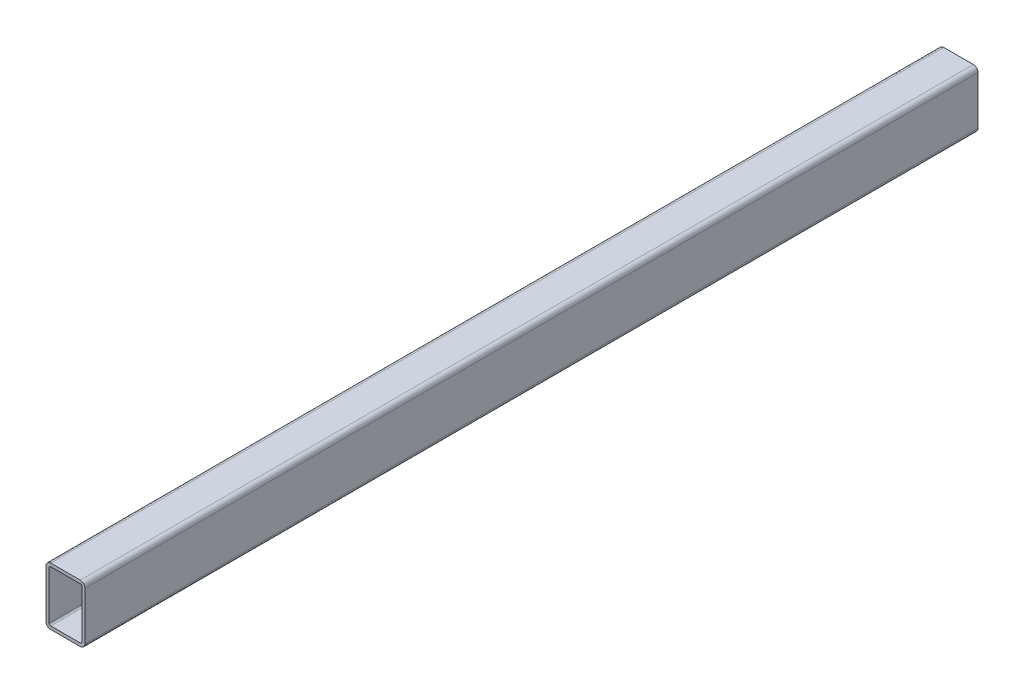
ISO-10303-21;
HEADER;
FILE_DESCRIPTION(('STEP AP214'),'2;1');
FILE_NAME('part.step','',(''),(''),'','','');
FILE_SCHEMA(('AUTOMOTIVE_DESIGN { 1 0 10303 214 1 1 1 1 }'));
ENDSEC;
DATA;
#1=APPLICATION_CONTEXT('core data for automotive mechanical design processes');
#2=APPLICATION_PROTOCOL_DEFINITION('international standard','automotive_design',2000,#1);
#3=PRODUCT_CONTEXT('',#1,'mechanical');
#4=PRODUCT('Part','Part','',(#3));
#5=PRODUCT_RELATED_PRODUCT_CATEGORY('part','',(#4));
#6=PRODUCT_DEFINITION_FORMATION('','',#4);
#7=PRODUCT_DEFINITION_CONTEXT('part definition',#1,'design');
#8=PRODUCT_DEFINITION('design','',#6,#7);
#9=PRODUCT_DEFINITION_SHAPE('','',#8);
#10=(LENGTH_UNIT() NAMED_UNIT(*) SI_UNIT(.MILLI.,.METRE.));
#11=(NAMED_UNIT(*) PLANE_ANGLE_UNIT() SI_UNIT($,.RADIAN.));
#12=(NAMED_UNIT(*) SI_UNIT($,.STERADIAN.) SOLID_ANGLE_UNIT());
#13=UNCERTAINTY_MEASURE_WITH_UNIT(LENGTH_MEASURE(1.E-05),#10,'distance_accuracy_value','');
#14=(GEOMETRIC_REPRESENTATION_CONTEXT(3) GLOBAL_UNCERTAINTY_ASSIGNED_CONTEXT((#13)) GLOBAL_UNIT_ASSIGNED_CONTEXT((#10,
#11,#12)) REPRESENTATION_CONTEXT('',''));
#15=CARTESIAN_POINT('',(0.,0.,0.));
#16=DIRECTION('',(0.,0.,1.));
#17=DIRECTION('',(1.,0.,0.));
#18=AXIS2_PLACEMENT_3D('',#15,#16,#17);
#19=CARTESIAN_POINT('',(-9.50000000000001,34.,287.));
#20=DIRECTION('',(0.,0.,1.));
#21=DIRECTION('',(1.,0.,0.));
#22=AXIS2_PLACEMENT_3D('',#19,#20,#21);
#23=PLANE('',#22);
#24=CARTESIAN_POINT('',(-9.50000000000001,34.,287.));
#25=DIRECTION('',(0.,0.,1.));
#26=DIRECTION('',(1.,0.,0.));
#27=AXIS2_PLACEMENT_3D('',#24,#25,#26);
#28=CIRCLE('',#27,3.);
#29=CARTESIAN_POINT('',(-9.49999999999999,37.,287.));
#30=VERTEX_POINT('',#29);
#31=CARTESIAN_POINT('',(-12.5,34.,287.));
#32=VERTEX_POINT('',#31);
#33=EDGE_CURVE('E262',#30,#32,#28,.T.);
#34=ORIENTED_EDGE('',*,*,#33,.T.);
#35=DIRECTION('',(0.,-1.,0.));
#36=VECTOR('',#35,1.);
#37=CARTESIAN_POINT('',(-12.5,34.,287.));
#38=LINE('',#37,#36);
#39=CARTESIAN_POINT('',(-12.5,3.00000000000002,287.));
#40=VERTEX_POINT('',#39);
#41=EDGE_CURVE('E265',#32,#40,#38,.T.);
#42=ORIENTED_EDGE('',*,*,#41,.T.);
#43=CARTESIAN_POINT('',(-9.5,3.,287.));
#44=DIRECTION('',(0.,0.,1.));
#45=DIRECTION('',(1.,0.,0.));
#46=AXIS2_PLACEMENT_3D('',#43,#44,#45);
#47=CIRCLE('',#46,3.);
#48=CARTESIAN_POINT('',(-9.49999999999998,0.,287.));
#49=VERTEX_POINT('',#48);
#50=EDGE_CURVE('E268',#40,#49,#47,.T.);
#51=ORIENTED_EDGE('',*,*,#50,.T.);
#52=DIRECTION('',(1.,0.,0.));
#53=VECTOR('',#52,1.);
#54=CARTESIAN_POINT('',(-9.49999999999998,0.,287.));
#55=LINE('',#54,#53);
#56=CARTESIAN_POINT('',(9.49999999999998,0.,287.));
#57=VERTEX_POINT('',#56);
#58=EDGE_CURVE('E270',#49,#57,#55,.T.);
#59=ORIENTED_EDGE('',*,*,#58,.T.);
#60=CARTESIAN_POINT('',(9.5,3.,287.));
#61=DIRECTION('',(0.,0.,1.));
#62=DIRECTION('',(1.,0.,0.));
#63=AXIS2_PLACEMENT_3D('',#60,#61,#62);
#64=CIRCLE('',#63,3.);
#65=CARTESIAN_POINT('',(12.5,3.00000000000002,287.));
#66=VERTEX_POINT('',#65);
#67=EDGE_CURVE('E272',#57,#66,#64,.T.);
#68=ORIENTED_EDGE('',*,*,#67,.T.);
#69=DIRECTION('',(0.,-1.,0.));
#70=VECTOR('',#69,1.);
#71=CARTESIAN_POINT('',(12.5,34.,287.));
#72=LINE('',#71,#70);
#73=CARTESIAN_POINT('',(12.5,34.,287.));
#74=VERTEX_POINT('',#73);
#75=EDGE_CURVE('E274',#74,#66,#72,.T.);
#76=ORIENTED_EDGE('',*,*,#75,.F.);
#77=CARTESIAN_POINT('',(9.50000000000001,34.,287.));
#78=DIRECTION('',(0.,0.,-1.));
#79=DIRECTION('',(-1.,0.,0.));
#80=AXIS2_PLACEMENT_3D('',#77,#78,#79);
#81=CIRCLE('',#80,3.);
#82=CARTESIAN_POINT('',(9.49999999999999,37.,287.));
#83=VERTEX_POINT('',#82);
#84=EDGE_CURVE('E277',#83,#74,#81,.T.);
#85=ORIENTED_EDGE('',*,*,#84,.F.);
#86=DIRECTION('',(1.,0.,0.));
#87=VECTOR('',#86,1.);
#88=CARTESIAN_POINT('',(-9.49999999999999,37.,287.));
#89=LINE('',#88,#87);
#90=EDGE_CURVE('E280',#30,#83,#89,.T.);
#91=ORIENTED_EDGE('',*,*,#90,.F.);
#92=EDGE_LOOP('',(#34,#42,#51,#59,#68,#76,#85,#91));
#93=FACE_BOUND('',#92,.T.);
#94=DIRECTION('',(0.,-1.,0.));
#95=VECTOR('',#94,1.);
#96=CARTESIAN_POINT('',(-10.5,34.,287.));
#97=LINE('',#96,#95);
#98=CARTESIAN_POINT('',(-10.5,34.,287.));
#99=VERTEX_POINT('',#98);
#100=CARTESIAN_POINT('',(-10.5,3.00000000000002,287.));
#101=VERTEX_POINT('',#100);
#102=EDGE_CURVE('E204',#99,#101,#97,.T.);
#103=ORIENTED_EDGE('',*,*,#102,.F.);
#104=CARTESIAN_POINT('',(-9.50000000000001,34.,287.));
#105=DIRECTION('',(0.,0.,1.));
#106=DIRECTION('',(1.,0.,0.));
#107=AXIS2_PLACEMENT_3D('',#104,#105,#106);
#108=CIRCLE('',#107,1.);
#109=CARTESIAN_POINT('',(-9.5,35.,287.));
#110=VERTEX_POINT('',#109);
#111=EDGE_CURVE('E195',#110,#99,#108,.T.);
#112=ORIENTED_EDGE('',*,*,#111,.F.);
#113=DIRECTION('',(1.,0.,0.));
#114=VECTOR('',#113,1.);
#115=CARTESIAN_POINT('',(-9.49999999999999,35.,287.));
#116=LINE('',#115,#114);
#117=CARTESIAN_POINT('',(9.49999999999999,35.,287.));
#118=VERTEX_POINT('',#117);
#119=EDGE_CURVE('E229',#110,#118,#116,.T.);
#120=ORIENTED_EDGE('',*,*,#119,.T.);
#121=CARTESIAN_POINT('',(9.50000000000001,34.,287.));
#122=DIRECTION('',(0.,0.,1.));
#123=DIRECTION('',(1.,0.,0.));
#124=AXIS2_PLACEMENT_3D('',#121,#122,#123);
#125=CIRCLE('',#124,1.);
#126=CARTESIAN_POINT('',(10.5,34.,287.));
#127=VERTEX_POINT('',#126);
#128=EDGE_CURVE('E98',#118,#127,#125,.F.);
#129=ORIENTED_EDGE('',*,*,#128,.T.);
#130=DIRECTION('',(0.,-1.,0.));
#131=VECTOR('',#130,1.);
#132=CARTESIAN_POINT('',(10.5,34.,287.));
#133=LINE('',#132,#131);
#134=CARTESIAN_POINT('',(10.5,3.00000000000002,287.));
#135=VERTEX_POINT('',#134);
#136=EDGE_CURVE('E225',#127,#135,#133,.T.);
#137=ORIENTED_EDGE('',*,*,#136,.T.);
#138=CARTESIAN_POINT('',(9.5,3.,287.));
#139=DIRECTION('',(0.,0.,1.));
#140=DIRECTION('',(1.,0.,0.));
#141=AXIS2_PLACEMENT_3D('',#138,#139,#140);
#142=CIRCLE('',#141,1.);
#143=CARTESIAN_POINT('',(9.49999999999998,2.,287.));
#144=VERTEX_POINT('',#143);
#145=EDGE_CURVE('E223',#144,#135,#142,.T.);
#146=ORIENTED_EDGE('',*,*,#145,.F.);
#147=DIRECTION('',(1.,0.,0.));
#148=VECTOR('',#147,1.);
#149=CARTESIAN_POINT('',(-9.49999999999998,2.,287.));
#150=LINE('',#149,#148);
#151=CARTESIAN_POINT('',(-9.49999999999999,2.,287.));
#152=VERTEX_POINT('',#151);
#153=EDGE_CURVE('E219',#152,#144,#150,.T.);
#154=ORIENTED_EDGE('',*,*,#153,.F.);
#155=CARTESIAN_POINT('',(-9.5,3.,287.));
#156=DIRECTION('',(0.,0.,1.));
#157=DIRECTION('',(1.,0.,0.));
#158=AXIS2_PLACEMENT_3D('',#155,#156,#157);
#159=CIRCLE('',#158,1.);
#160=EDGE_CURVE('E217',#101,#152,#159,.T.);
#161=ORIENTED_EDGE('',*,*,#160,.F.);
#162=EDGE_LOOP('',(#103,#112,#120,#129,#137,#146,#154,#161));
#163=FACE_BOUND('',#162,.T.);
#164=ADVANCED_FACE('F83',(#93,#163),#23,.T.);
#165=CARTESIAN_POINT('',(-9.50000000000001,34.,-287.));
#166=DIRECTION('',(0.,0.,1.));
#167=DIRECTION('',(1.,0.,0.));
#168=AXIS2_PLACEMENT_3D('',#165,#166,#167);
#169=PLANE('',#168);
#170=CARTESIAN_POINT('',(-9.50000000000001,34.,-287.));
#171=DIRECTION('',(0.,0.,1.));
#172=DIRECTION('',(1.,0.,0.));
#173=AXIS2_PLACEMENT_3D('',#170,#171,#172);
#174=CIRCLE('',#173,3.);
#175=CARTESIAN_POINT('',(-9.49999999999999,37.,-287.));
#176=VERTEX_POINT('',#175);
#177=CARTESIAN_POINT('',(-12.5,34.,-287.));
#178=VERTEX_POINT('',#177);
#179=EDGE_CURVE('E212',#176,#178,#174,.T.);
#180=ORIENTED_EDGE('',*,*,#179,.F.);
#181=DIRECTION('',(1.,0.,0.));
#182=VECTOR('',#181,1.);
#183=CARTESIAN_POINT('',(-9.49999999999999,37.,-287.));
#184=LINE('',#183,#182);
#185=CARTESIAN_POINT('',(9.49999999999999,37.,-287.));
#186=VERTEX_POINT('',#185);
#187=EDGE_CURVE('E266',#176,#186,#184,.T.);
#188=ORIENTED_EDGE('',*,*,#187,.T.);
#189=CARTESIAN_POINT('',(9.50000000000001,34.,-287.));
#190=DIRECTION('',(0.,0.,-1.));
#191=DIRECTION('',(-1.,0.,0.));
#192=AXIS2_PLACEMENT_3D('',#189,#190,#191);
#193=CIRCLE('',#192,3.);
#194=CARTESIAN_POINT('',(12.5,34.,-287.));
#195=VERTEX_POINT('',#194);
#196=EDGE_CURVE('E298',#186,#195,#193,.T.);
#197=ORIENTED_EDGE('',*,*,#196,.T.);
#198=DIRECTION('',(0.,-1.,0.));
#199=VECTOR('',#198,1.);
#200=CARTESIAN_POINT('',(12.5,34.,-287.));
#201=LINE('',#200,#199);
#202=CARTESIAN_POINT('',(12.5,3.00000000000002,-287.));
#203=VERTEX_POINT('',#202);
#204=EDGE_CURVE('E295',#195,#203,#201,.T.);
#205=ORIENTED_EDGE('',*,*,#204,.T.);
#206=CARTESIAN_POINT('',(9.5,3.,-287.));
#207=DIRECTION('',(0.,0.,1.));
#208=DIRECTION('',(1.,0.,0.));
#209=AXIS2_PLACEMENT_3D('',#206,#207,#208);
#210=CIRCLE('',#209,3.);
#211=CARTESIAN_POINT('',(9.49999999999998,0.,-287.));
#212=VERTEX_POINT('',#211);
#213=EDGE_CURVE('E292',#212,#203,#210,.T.);
#214=ORIENTED_EDGE('',*,*,#213,.F.);
#215=DIRECTION('',(1.,0.,0.));
#216=VECTOR('',#215,1.);
#217=CARTESIAN_POINT('',(-9.49999999999998,0.,-287.));
#218=LINE('',#217,#216);
#219=CARTESIAN_POINT('',(-9.49999999999998,0.,-287.));
#220=VERTEX_POINT('',#219);
#221=EDGE_CURVE('E290',#220,#212,#218,.T.);
#222=ORIENTED_EDGE('',*,*,#221,.F.);
#223=CARTESIAN_POINT('',(-9.5,3.,-287.));
#224=DIRECTION('',(0.,0.,1.));
#225=DIRECTION('',(1.,0.,0.));
#226=AXIS2_PLACEMENT_3D('',#223,#224,#225);
#227=CIRCLE('',#226,3.);
#228=CARTESIAN_POINT('',(-12.5,3.00000000000002,-287.));
#229=VERTEX_POINT('',#228);
#230=EDGE_CURVE('E288',#229,#220,#227,.T.);
#231=ORIENTED_EDGE('',*,*,#230,.F.);
#232=DIRECTION('',(0.,-1.,0.));
#233=VECTOR('',#232,1.);
#234=CARTESIAN_POINT('',(-12.5,34.,-287.));
#235=LINE('',#234,#233);
#236=EDGE_CURVE('E286',#178,#229,#235,.T.);
#237=ORIENTED_EDGE('',*,*,#236,.F.);
#238=EDGE_LOOP('',(#180,#188,#197,#205,#214,#222,#231,#237));
#239=FACE_BOUND('',#238,.T.);
#240=CARTESIAN_POINT('',(-9.50000000000001,34.,-287.));
#241=DIRECTION('',(0.,0.,1.));
#242=DIRECTION('',(1.,0.,0.));
#243=AXIS2_PLACEMENT_3D('',#240,#241,#242);
#244=CIRCLE('',#243,1.);
#245=CARTESIAN_POINT('',(-9.5,35.,-287.));
#246=VERTEX_POINT('',#245);
#247=CARTESIAN_POINT('',(-10.5,34.,-287.));
#248=VERTEX_POINT('',#247);
#249=EDGE_CURVE('E106',#246,#248,#244,.T.);
#250=ORIENTED_EDGE('',*,*,#249,.T.);
#251=DIRECTION('',(0.,-1.,0.));
#252=VECTOR('',#251,1.);
#253=CARTESIAN_POINT('',(-10.5,34.,-287.));
#254=LINE('',#253,#252);
#255=CARTESIAN_POINT('',(-10.5,3.00000000000002,-287.));
#256=VERTEX_POINT('',#255);
#257=EDGE_CURVE('E211',#248,#256,#254,.T.);
#258=ORIENTED_EDGE('',*,*,#257,.T.);
#259=CARTESIAN_POINT('',(-9.5,3.,-287.));
#260=DIRECTION('',(0.,0.,1.));
#261=DIRECTION('',(1.,0.,0.));
#262=AXIS2_PLACEMENT_3D('',#259,#260,#261);
#263=CIRCLE('',#262,1.);
#264=CARTESIAN_POINT('',(-9.49999999999999,2.,-287.));
#265=VERTEX_POINT('',#264);
#266=EDGE_CURVE('E233',#256,#265,#263,.T.);
#267=ORIENTED_EDGE('',*,*,#266,.T.);
#268=DIRECTION('',(1.,0.,0.));
#269=VECTOR('',#268,1.);
#270=CARTESIAN_POINT('',(-9.49999999999998,2.,-287.));
#271=LINE('',#270,#269);
#272=CARTESIAN_POINT('',(9.49999999999998,2.,-287.));
#273=VERTEX_POINT('',#272);
#274=EDGE_CURVE('E236',#265,#273,#271,.T.);
#275=ORIENTED_EDGE('',*,*,#274,.T.);
#276=CARTESIAN_POINT('',(9.5,3.,-287.));
#277=DIRECTION('',(0.,0.,1.));
#278=DIRECTION('',(1.,0.,0.));
#279=AXIS2_PLACEMENT_3D('',#276,#277,#278);
#280=CIRCLE('',#279,1.);
#281=CARTESIAN_POINT('',(10.5,3.00000000000002,-287.));
#282=VERTEX_POINT('',#281);
#283=EDGE_CURVE('E239',#273,#282,#280,.T.);
#284=ORIENTED_EDGE('',*,*,#283,.T.);
#285=DIRECTION('',(0.,-1.,0.));
#286=VECTOR('',#285,1.);
#287=CARTESIAN_POINT('',(10.5,34.,-287.));
#288=LINE('',#287,#286);
#289=CARTESIAN_POINT('',(10.5,34.,-287.));
#290=VERTEX_POINT('',#289);
#291=EDGE_CURVE('E242',#290,#282,#288,.T.);
#292=ORIENTED_EDGE('',*,*,#291,.F.);
#293=CARTESIAN_POINT('',(9.50000000000001,34.,-287.));
#294=DIRECTION('',(0.,0.,1.));
#295=DIRECTION('',(1.,0.,0.));
#296=AXIS2_PLACEMENT_3D('',#293,#294,#295);
#297=CIRCLE('',#296,1.);
#298=CARTESIAN_POINT('',(9.49999999999999,35.,-287.));
#299=VERTEX_POINT('',#298);
#300=EDGE_CURVE('E245',#299,#290,#297,.F.);
#301=ORIENTED_EDGE('',*,*,#300,.F.);
#302=DIRECTION('',(1.,0.,0.));
#303=VECTOR('',#302,1.);
#304=CARTESIAN_POINT('',(-9.49999999999999,35.,-287.));
#305=LINE('',#304,#303);
#306=EDGE_CURVE('E205',#246,#299,#305,.T.);
#307=ORIENTED_EDGE('',*,*,#306,.F.);
#308=EDGE_LOOP('',(#250,#258,#267,#275,#284,#292,#301,#307));
#309=FACE_BOUND('',#308,.T.);
#310=ADVANCED_FACE('F326',(#239,#309),#169,.F.);
#311=CARTESIAN_POINT('',(-9.50000000000001,34.,287.));
#312=DIRECTION('',(0.,0.,-1.));
#313=DIRECTION('',(-1.,0.,0.));
#314=AXIS2_PLACEMENT_3D('',#311,#312,#313);
#315=CYLINDRICAL_SURFACE('',#314,3.);
#316=ORIENTED_EDGE('',*,*,#179,.T.);
#317=DIRECTION('',(0.,0.,-1.));
#318=VECTOR('',#317,1.);
#319=CARTESIAN_POINT('',(-12.5,34.,287.));
#320=LINE('',#319,#318);
#321=EDGE_CURVE('E12',#32,#178,#320,.T.);
#322=ORIENTED_EDGE('',*,*,#321,.F.);
#323=ORIENTED_EDGE('',*,*,#33,.F.);
#324=DIRECTION('',(0.,0.,-1.));
#325=VECTOR('',#324,1.);
#326=CARTESIAN_POINT('',(-9.49999999999999,37.,287.));
#327=LINE('',#326,#325);
#328=EDGE_CURVE('E283',#30,#176,#327,.T.);
#329=ORIENTED_EDGE('',*,*,#328,.T.);
#330=EDGE_LOOP('',(#316,#322,#323,#329));
#331=FACE_BOUND('',#330,.T.);
#332=ADVANCED_FACE('F85',(#331),#315,.T.);
#333=CARTESIAN_POINT('',(-12.5,34.,287.));
#334=DIRECTION('',(1.,0.,0.));
#335=DIRECTION('',(0.,1.,0.));
#336=AXIS2_PLACEMENT_3D('',#333,#334,#335);
#337=PLANE('',#336);
#338=ORIENTED_EDGE('',*,*,#236,.T.);
#339=DIRECTION('',(0.,0.,-1.));
#340=VECTOR('',#339,1.);
#341=CARTESIAN_POINT('',(-12.5,3.00000000000002,287.));
#342=LINE('',#341,#340);
#343=EDGE_CURVE('E91',#40,#229,#342,.T.);
#344=ORIENTED_EDGE('',*,*,#343,.F.);
#345=ORIENTED_EDGE('',*,*,#41,.F.);
#346=ORIENTED_EDGE('',*,*,#321,.T.);
#347=EDGE_LOOP('',(#338,#344,#345,#346));
#348=FACE_BOUND('',#347,.T.);
#349=ADVANCED_FACE('F343',(#348),#337,.F.);
#350=CARTESIAN_POINT('',(-9.5,3.,287.));
#351=DIRECTION('',(0.,0.,-1.));
#352=DIRECTION('',(-1.,0.,0.));
#353=AXIS2_PLACEMENT_3D('',#350,#351,#352);
#354=CYLINDRICAL_SURFACE('',#353,3.);
#355=ORIENTED_EDGE('',*,*,#230,.T.);
#356=DIRECTION('',(0.,0.,-1.));
#357=VECTOR('',#356,1.);
#358=CARTESIAN_POINT('',(-9.49999999999998,0.,287.));
#359=LINE('',#358,#357);
#360=EDGE_CURVE('E313',#49,#220,#359,.T.);
#361=ORIENTED_EDGE('',*,*,#360,.F.);
#362=ORIENTED_EDGE('',*,*,#50,.F.);
#363=ORIENTED_EDGE('',*,*,#343,.T.);
#364=EDGE_LOOP('',(#355,#361,#362,#363));
#365=FACE_BOUND('',#364,.T.);
#366=ADVANCED_FACE('F320',(#365),#354,.T.);
#367=CARTESIAN_POINT('',(-9.49999999999998,0.,287.));
#368=DIRECTION('',(0.,1.,0.));
#369=DIRECTION('',(0.,0.,1.));
#370=AXIS2_PLACEMENT_3D('',#367,#368,#369);
#371=PLANE('',#370);
#372=ORIENTED_EDGE('',*,*,#221,.T.);
#373=DIRECTION('',(0.,0.,-1.));
#374=VECTOR('',#373,1.);
#375=CARTESIAN_POINT('',(9.49999999999998,0.,287.));
#376=LINE('',#375,#374);
#377=EDGE_CURVE('E310',#57,#212,#376,.T.);
#378=ORIENTED_EDGE('',*,*,#377,.F.);
#379=ORIENTED_EDGE('',*,*,#58,.F.);
#380=ORIENTED_EDGE('',*,*,#360,.T.);
#381=EDGE_LOOP('',(#372,#378,#379,#380));
#382=FACE_BOUND('',#381,.T.);
#383=ADVANCED_FACE('F331',(#382),#371,.F.);
#384=CARTESIAN_POINT('',(9.5,3.,287.));
#385=DIRECTION('',(0.,0.,-1.));
#386=DIRECTION('',(-1.,0.,0.));
#387=AXIS2_PLACEMENT_3D('',#384,#385,#386);
#388=CYLINDRICAL_SURFACE('',#387,3.);
#389=ORIENTED_EDGE('',*,*,#213,.T.);
#390=DIRECTION('',(0.,0.,-1.));
#391=VECTOR('',#390,1.);
#392=CARTESIAN_POINT('',(12.5,3.00000000000002,287.));
#393=LINE('',#392,#391);
#394=EDGE_CURVE('E308',#66,#203,#393,.T.);
#395=ORIENTED_EDGE('',*,*,#394,.F.);
#396=ORIENTED_EDGE('',*,*,#67,.F.);
#397=ORIENTED_EDGE('',*,*,#377,.T.);
#398=EDGE_LOOP('',(#389,#395,#396,#397));
#399=FACE_BOUND('',#398,.T.);
#400=ADVANCED_FACE('F335',(#399),#388,.T.);
#401=CARTESIAN_POINT('',(12.5,34.,287.));
#402=DIRECTION('',(1.,0.,0.));
#403=DIRECTION('',(0.,1.,0.));
#404=AXIS2_PLACEMENT_3D('',#401,#402,#403);
#405=PLANE('',#404);
#406=ORIENTED_EDGE('',*,*,#204,.F.);
#407=DIRECTION('',(0.,0.,-1.));
#408=VECTOR('',#407,1.);
#409=CARTESIAN_POINT('',(12.5,34.,287.));
#410=LINE('',#409,#408);
#411=EDGE_CURVE('E306',#74,#195,#410,.T.);
#412=ORIENTED_EDGE('',*,*,#411,.F.);
#413=ORIENTED_EDGE('',*,*,#75,.T.);
#414=ORIENTED_EDGE('',*,*,#394,.T.);
#415=EDGE_LOOP('',(#406,#412,#413,#414));
#416=FACE_BOUND('',#415,.T.);
#417=ADVANCED_FACE('F353',(#416),#405,.T.);
#418=CARTESIAN_POINT('',(9.50000000000001,34.,287.));
#419=DIRECTION('',(0.,0.,-1.));
#420=DIRECTION('',(-1.,0.,0.));
#421=AXIS2_PLACEMENT_3D('',#418,#419,#420);
#422=CYLINDRICAL_SURFACE('',#421,3.);
#423=ORIENTED_EDGE('',*,*,#196,.F.);
#424=DIRECTION('',(0.,0.,-1.));
#425=VECTOR('',#424,1.);
#426=CARTESIAN_POINT('',(9.49999999999999,37.,287.));
#427=LINE('',#426,#425);
#428=EDGE_CURVE('E304',#83,#186,#427,.T.);
#429=ORIENTED_EDGE('',*,*,#428,.F.);
#430=ORIENTED_EDGE('',*,*,#84,.T.);
#431=ORIENTED_EDGE('',*,*,#411,.T.);
#432=EDGE_LOOP('',(#423,#429,#430,#431));
#433=FACE_BOUND('',#432,.T.);
#434=ADVANCED_FACE('F350',(#433),#422,.T.);
#435=CARTESIAN_POINT('',(-9.49999999999999,37.,287.));
#436=DIRECTION('',(0.,1.,0.));
#437=DIRECTION('',(0.,0.,1.));
#438=AXIS2_PLACEMENT_3D('',#435,#436,#437);
#439=PLANE('',#438);
#440=ORIENTED_EDGE('',*,*,#187,.F.);
#441=ORIENTED_EDGE('',*,*,#328,.F.);
#442=ORIENTED_EDGE('',*,*,#90,.T.);
#443=ORIENTED_EDGE('',*,*,#428,.T.);
#444=EDGE_LOOP('',(#440,#441,#442,#443));
#445=FACE_BOUND('',#444,.T.);
#446=ADVANCED_FACE('F347',(#445),#439,.T.);
#447=CARTESIAN_POINT('',(-9.50000000000001,34.,287.));
#448=DIRECTION('',(0.,0.,-1.));
#449=DIRECTION('',(-1.,0.,0.));
#450=AXIS2_PLACEMENT_3D('',#447,#448,#449);
#451=CYLINDRICAL_SURFACE('',#450,1.);
#452=ORIENTED_EDGE('',*,*,#249,.F.);
#453=DIRECTION('',(0.,0.,-1.));
#454=VECTOR('',#453,1.);
#455=CARTESIAN_POINT('',(-9.5,35.,287.));
#456=LINE('',#455,#454);
#457=EDGE_CURVE('E199',#110,#246,#456,.T.);
#458=ORIENTED_EDGE('',*,*,#457,.F.);
#459=ORIENTED_EDGE('',*,*,#111,.T.);
#460=DIRECTION('',(0.,0.,-1.));
#461=VECTOR('',#460,1.);
#462=CARTESIAN_POINT('',(-10.5,34.,287.));
#463=LINE('',#462,#461);
#464=EDGE_CURVE('E198',#99,#248,#463,.T.);
#465=ORIENTED_EDGE('',*,*,#464,.T.);
#466=EDGE_LOOP('',(#452,#458,#459,#465));
#467=FACE_BOUND('',#466,.T.);
#468=ADVANCED_FACE('F197',(#467),#451,.F.);
#469=CARTESIAN_POINT('',(-10.5,34.,287.));
#470=DIRECTION('',(1.,0.,0.));
#471=DIRECTION('',(0.,1.,0.));
#472=AXIS2_PLACEMENT_3D('',#469,#470,#471);
#473=PLANE('',#472);
#474=ORIENTED_EDGE('',*,*,#257,.F.);
#475=ORIENTED_EDGE('',*,*,#464,.F.);
#476=ORIENTED_EDGE('',*,*,#102,.T.);
#477=DIRECTION('',(0.,0.,-1.));
#478=VECTOR('',#477,1.);
#479=CARTESIAN_POINT('',(-10.5,3.00000000000002,287.));
#480=LINE('',#479,#478);
#481=EDGE_CURVE('E213',#101,#256,#480,.T.);
#482=ORIENTED_EDGE('',*,*,#481,.T.);
#483=EDGE_LOOP('',(#474,#475,#476,#482));
#484=FACE_BOUND('',#483,.T.);
#485=ADVANCED_FACE('F208',(#484),#473,.T.);
#486=CARTESIAN_POINT('',(-9.5,3.,287.));
#487=DIRECTION('',(0.,0.,-1.));
#488=DIRECTION('',(-1.,0.,0.));
#489=AXIS2_PLACEMENT_3D('',#486,#487,#488);
#490=CYLINDRICAL_SURFACE('',#489,1.);
#491=ORIENTED_EDGE('',*,*,#266,.F.);
#492=ORIENTED_EDGE('',*,*,#481,.F.);
#493=ORIENTED_EDGE('',*,*,#160,.T.);
#494=DIRECTION('',(0.,0.,-1.));
#495=VECTOR('',#494,1.);
#496=CARTESIAN_POINT('',(-9.49999999999999,2.,287.));
#497=LINE('',#496,#495);
#498=EDGE_CURVE('E259',#152,#265,#497,.T.);
#499=ORIENTED_EDGE('',*,*,#498,.T.);
#500=EDGE_LOOP('',(#491,#492,#493,#499));
#501=FACE_BOUND('',#500,.T.);
#502=ADVANCED_FACE('F378',(#501),#490,.F.);
#503=CARTESIAN_POINT('',(-9.49999999999998,2.,287.));
#504=DIRECTION('',(0.,1.,0.));
#505=DIRECTION('',(0.,0.,1.));
#506=AXIS2_PLACEMENT_3D('',#503,#504,#505);
#507=PLANE('',#506);
#508=ORIENTED_EDGE('',*,*,#274,.F.);
#509=ORIENTED_EDGE('',*,*,#498,.F.);
#510=ORIENTED_EDGE('',*,*,#153,.T.);
#511=DIRECTION('',(0.,0.,-1.));
#512=VECTOR('',#511,1.);
#513=CARTESIAN_POINT('',(9.49999999999998,2.,287.));
#514=LINE('',#513,#512);
#515=EDGE_CURVE('E257',#144,#273,#514,.T.);
#516=ORIENTED_EDGE('',*,*,#515,.T.);
#517=EDGE_LOOP('',(#508,#509,#510,#516));
#518=FACE_BOUND('',#517,.T.);
#519=ADVANCED_FACE('F382',(#518),#507,.T.);
#520=CARTESIAN_POINT('',(9.5,3.,287.));
#521=DIRECTION('',(0.,0.,-1.));
#522=DIRECTION('',(-1.,0.,0.));
#523=AXIS2_PLACEMENT_3D('',#520,#521,#522);
#524=CYLINDRICAL_SURFACE('',#523,1.);
#525=ORIENTED_EDGE('',*,*,#283,.F.);
#526=ORIENTED_EDGE('',*,*,#515,.F.);
#527=ORIENTED_EDGE('',*,*,#145,.T.);
#528=DIRECTION('',(0.,0.,-1.));
#529=VECTOR('',#528,1.);
#530=CARTESIAN_POINT('',(10.5,3.00000000000002,287.));
#531=LINE('',#530,#529);
#532=EDGE_CURVE('E255',#135,#282,#531,.T.);
#533=ORIENTED_EDGE('',*,*,#532,.T.);
#534=EDGE_LOOP('',(#525,#526,#527,#533));
#535=FACE_BOUND('',#534,.T.);
#536=ADVANCED_FACE('F388',(#535),#524,.F.);
#537=CARTESIAN_POINT('',(10.5,34.,287.));
#538=DIRECTION('',(1.,0.,0.));
#539=DIRECTION('',(0.,1.,0.));
#540=AXIS2_PLACEMENT_3D('',#537,#538,#539);
#541=PLANE('',#540);
#542=ORIENTED_EDGE('',*,*,#291,.T.);
#543=ORIENTED_EDGE('',*,*,#532,.F.);
#544=ORIENTED_EDGE('',*,*,#136,.F.);
#545=DIRECTION('',(0.,0.,-1.));
#546=VECTOR('',#545,1.);
#547=CARTESIAN_POINT('',(10.5,34.,287.));
#548=LINE('',#547,#546);
#549=EDGE_CURVE('E253',#127,#290,#548,.T.);
#550=ORIENTED_EDGE('',*,*,#549,.T.);
#551=EDGE_LOOP('',(#542,#543,#544,#550));
#552=FACE_BOUND('',#551,.T.);
#553=ADVANCED_FACE('F392',(#552),#541,.F.);
#554=CARTESIAN_POINT('',(9.50000000000001,34.,287.));
#555=DIRECTION('',(0.,0.,-1.));
#556=DIRECTION('',(-1.,0.,0.));
#557=AXIS2_PLACEMENT_3D('',#554,#555,#556);
#558=CYLINDRICAL_SURFACE('',#557,1.);
#559=ORIENTED_EDGE('',*,*,#300,.T.);
#560=ORIENTED_EDGE('',*,*,#549,.F.);
#561=ORIENTED_EDGE('',*,*,#128,.F.);
#562=DIRECTION('',(0.,0.,-1.));
#563=VECTOR('',#562,1.);
#564=CARTESIAN_POINT('',(9.49999999999999,35.,287.));
#565=LINE('',#564,#563);
#566=EDGE_CURVE('E251',#118,#299,#565,.T.);
#567=ORIENTED_EDGE('',*,*,#566,.T.);
#568=EDGE_LOOP('',(#559,#560,#561,#567));
#569=FACE_BOUND('',#568,.T.);
#570=ADVANCED_FACE('F396',(#569),#558,.F.);
#571=CARTESIAN_POINT('',(-9.49999999999999,35.,287.));
#572=DIRECTION('',(0.,1.,0.));
#573=DIRECTION('',(0.,0.,1.));
#574=AXIS2_PLACEMENT_3D('',#571,#572,#573);
#575=PLANE('',#574);
#576=ORIENTED_EDGE('',*,*,#306,.T.);
#577=ORIENTED_EDGE('',*,*,#566,.F.);
#578=ORIENTED_EDGE('',*,*,#119,.F.);
#579=ORIENTED_EDGE('',*,*,#457,.T.);
#580=EDGE_LOOP('',(#576,#577,#578,#579));
#581=FACE_BOUND('',#580,.T.);
#582=ADVANCED_FACE('F400',(#581),#575,.F.);
#583=CLOSED_SHELL('',(#164,#310,#332,#349,#366,#383,#400,#417,#434,#446,#468,#485,#502,#519,
#536,#553,#570,#582));
#584=MANIFOLD_SOLID_BREP('B2',#583);
#585=ADVANCED_BREP_SHAPE_REPRESENTATION('',(#18,#584),#14);
#586=SHAPE_DEFINITION_REPRESENTATION(#9,#585);
ENDSEC;
END-ISO-10303-21;
